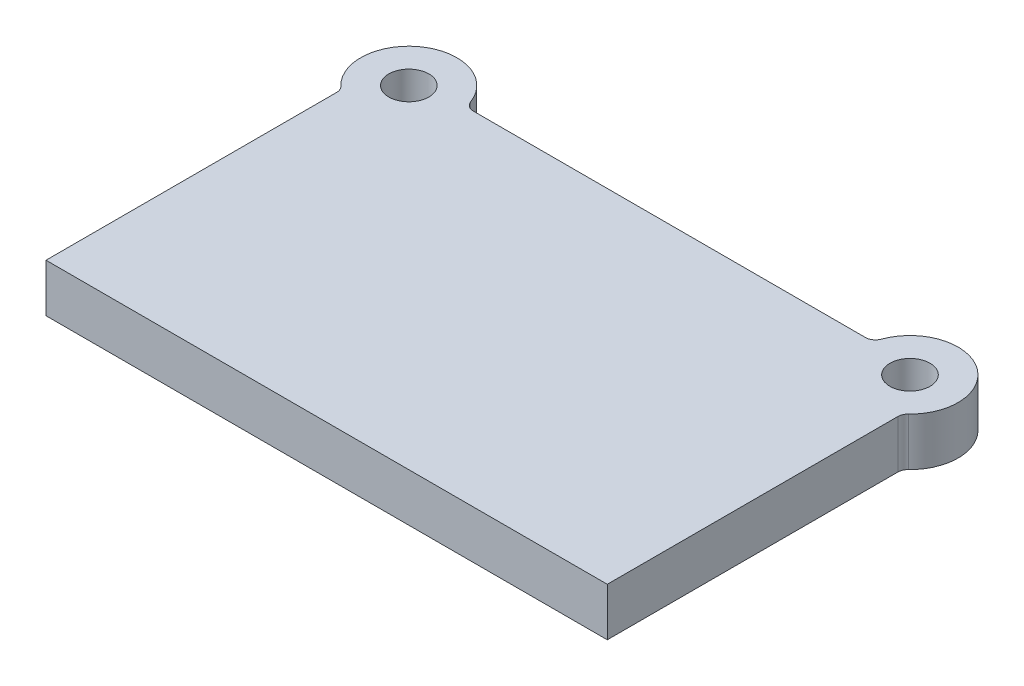
ISO-10303-21;
HEADER;
FILE_DESCRIPTION(('STEP AP214'),'2;1');
FILE_NAME('part.step','',(''),(''),'','','');
FILE_SCHEMA(('AUTOMOTIVE_DESIGN { 1 0 10303 214 1 1 1 1 }'));
ENDSEC;
DATA;
#1=APPLICATION_CONTEXT('core data for automotive mechanical design processes');
#2=APPLICATION_PROTOCOL_DEFINITION('international standard','automotive_design',2000,#1);
#3=PRODUCT_CONTEXT('',#1,'mechanical');
#4=PRODUCT('Part','Part','',(#3));
#5=PRODUCT_RELATED_PRODUCT_CATEGORY('part','',(#4));
#6=PRODUCT_DEFINITION_FORMATION('','',#4);
#7=PRODUCT_DEFINITION_CONTEXT('part definition',#1,'design');
#8=PRODUCT_DEFINITION('design','',#6,#7);
#9=PRODUCT_DEFINITION_SHAPE('','',#8);
#10=(LENGTH_UNIT() NAMED_UNIT(*) SI_UNIT(.MILLI.,.METRE.));
#11=(NAMED_UNIT(*) PLANE_ANGLE_UNIT() SI_UNIT($,.RADIAN.));
#12=(NAMED_UNIT(*) SI_UNIT($,.STERADIAN.) SOLID_ANGLE_UNIT());
#13=UNCERTAINTY_MEASURE_WITH_UNIT(LENGTH_MEASURE(1.E-05),#10,'distance_accuracy_value','');
#14=(GEOMETRIC_REPRESENTATION_CONTEXT(3) GLOBAL_UNCERTAINTY_ASSIGNED_CONTEXT((#13)) GLOBAL_UNIT_ASSIGNED_CONTEXT((#10,
#11,#12)) REPRESENTATION_CONTEXT('',''));
#15=CARTESIAN_POINT('',(0.,0.,0.));
#16=DIRECTION('',(0.,0.,1.));
#17=DIRECTION('',(1.,0.,0.));
#18=AXIS2_PLACEMENT_3D('',#15,#16,#17);
#19=CARTESIAN_POINT('',(-250.,48.,-332.));
#20=DIRECTION('',(0.,1.,0.));
#21=DIRECTION('',(0.,0.,1.));
#22=AXIS2_PLACEMENT_3D('',#19,#20,#21);
#23=PLANE('',#22);
#24=CARTESIAN_POINT('',(-250.,48.,-332.));
#25=DIRECTION('',(0.,1.,0.));
#26=DIRECTION('',(0.,0.,1.));
#27=AXIS2_PLACEMENT_3D('',#24,#25,#26);
#28=CIRCLE('',#27,20.);
#29=CARTESIAN_POINT('',(-250.,48.,-312.));
#30=VERTEX_POINT('',#29);
#31=EDGE_CURVE('E209',#30,#30,#28,.T.);
#32=ORIENTED_EDGE('',*,*,#31,.F.);
#33=EDGE_LOOP('',(#32));
#34=FACE_BOUND('',#33,.T.);
#35=CARTESIAN_POINT('',(-250.,48.,-332.));
#36=DIRECTION('',(0.,1.,0.));
#37=DIRECTION('',(0.,0.,1.));
#38=AXIS2_PLACEMENT_3D('',#35,#36,#37);
#39=CIRCLE('',#38,48.);
#40=CARTESIAN_POINT('',(-204.944030050815,48.,-348.551724137931));
#41=VERTEX_POINT('',#40);
#42=CARTESIAN_POINT('',(-283.103448275862,48.,-297.241379310345));
#43=VERTEX_POINT('',#42);
#44=EDGE_CURVE('E139',#41,#43,#39,.T.);
#45=ORIENTED_EDGE('',*,*,#44,.T.);
#46=CARTESIAN_POINT('',(-290.,48.,-290.));
#47=DIRECTION('',(0.,1.,0.));
#48=DIRECTION('',(0.,0.,1.));
#49=AXIS2_PLACEMENT_3D('',#46,#47,#48);
#50=CIRCLE('',#49,10.);
#51=CARTESIAN_POINT('',(-280.,48.,-290.));
#52=VERTEX_POINT('',#51);
#53=EDGE_CURVE('E116',#43,#52,#50,.F.);
#54=ORIENTED_EDGE('',*,*,#53,.T.);
#55=DIRECTION('',(0.,0.,1.));
#56=VECTOR('',#55,1.);
#57=CARTESIAN_POINT('',(-280.,48.,0.));
#58=LINE('',#57,#56);
#59=CARTESIAN_POINT('',(-280.,48.,0.));
#60=VERTEX_POINT('',#59);
#61=EDGE_CURVE('E109',#52,#60,#58,.T.);
#62=ORIENTED_EDGE('',*,*,#61,.T.);
#63=DIRECTION('',(1.,0.,0.));
#64=VECTOR('',#63,1.);
#65=CARTESIAN_POINT('',(280.,48.,0.));
#66=LINE('',#65,#64);
#67=CARTESIAN_POINT('',(280.,48.,0.));
#68=VERTEX_POINT('',#67);
#69=EDGE_CURVE('E113',#60,#68,#66,.T.);
#70=ORIENTED_EDGE('',*,*,#69,.T.);
#71=DIRECTION('',(0.,0.,-1.));
#72=VECTOR('',#71,1.);
#73=CARTESIAN_POINT('',(280.,48.,0.));
#74=LINE('',#73,#72);
#75=CARTESIAN_POINT('',(280.,48.,-290.));
#76=VERTEX_POINT('',#75);
#77=EDGE_CURVE('E129',#68,#76,#74,.T.);
#78=ORIENTED_EDGE('',*,*,#77,.T.);
#79=CARTESIAN_POINT('',(290.,48.,-290.));
#80=DIRECTION('',(0.,1.,0.));
#81=DIRECTION('',(0.,0.,1.));
#82=AXIS2_PLACEMENT_3D('',#79,#80,#81);
#83=CIRCLE('',#82,10.);
#84=CARTESIAN_POINT('',(283.103448275862,48.,-297.241379310345));
#85=VERTEX_POINT('',#84);
#86=EDGE_CURVE('E11',#76,#85,#83,.F.);
#87=ORIENTED_EDGE('',*,*,#86,.T.);
#88=CARTESIAN_POINT('',(250.,48.,-332.));
#89=DIRECTION('',(0.,1.,0.));
#90=DIRECTION('',(0.,0.,-1.));
#91=AXIS2_PLACEMENT_3D('',#88,#89,#90);
#92=CIRCLE('',#91,48.);
#93=CARTESIAN_POINT('',(204.944030050815,48.,-348.551724137931));
#94=VERTEX_POINT('',#93);
#95=EDGE_CURVE('E175',#85,#94,#92,.T.);
#96=ORIENTED_EDGE('',*,*,#95,.T.);
#97=CARTESIAN_POINT('',(195.557369644735,48.,-352.));
#98=DIRECTION('',(0.,1.,0.));
#99=DIRECTION('',(0.,0.,1.));
#100=AXIS2_PLACEMENT_3D('',#97,#98,#99);
#101=CIRCLE('',#100,10.);
#102=CARTESIAN_POINT('',(195.557369644735,48.,-342.));
#103=VERTEX_POINT('',#102);
#104=EDGE_CURVE('E167',#94,#103,#101,.F.);
#105=ORIENTED_EDGE('',*,*,#104,.T.);
#106=DIRECTION('',(-1.,0.,0.));
#107=VECTOR('',#106,1.);
#108=CARTESIAN_POINT('',(203.053221622778,48.,-342.));
#109=LINE('',#108,#107);
#110=CARTESIAN_POINT('',(-195.557369644735,48.,-342.));
#111=VERTEX_POINT('',#110);
#112=EDGE_CURVE('E172',#103,#111,#109,.T.);
#113=ORIENTED_EDGE('',*,*,#112,.T.);
#114=CARTESIAN_POINT('',(-195.557369644735,48.,-352.));
#115=DIRECTION('',(0.,1.,0.));
#116=DIRECTION('',(0.,0.,1.));
#117=AXIS2_PLACEMENT_3D('',#114,#115,#116);
#118=CIRCLE('',#117,10.);
#119=EDGE_CURVE('E163',#111,#41,#118,.F.);
#120=ORIENTED_EDGE('',*,*,#119,.T.);
#121=EDGE_LOOP('',(#45,#54,#62,#70,#78,#87,#96,#105,#113,#120));
#122=FACE_BOUND('',#121,.T.);
#123=CARTESIAN_POINT('',(250.,48.,-332.));
#124=DIRECTION('',(0.,1.,0.));
#125=DIRECTION('',(0.,0.,-1.));
#126=AXIS2_PLACEMENT_3D('',#123,#124,#125);
#127=CIRCLE('',#126,20.);
#128=CARTESIAN_POINT('',(250.,48.,-352.));
#129=VERTEX_POINT('',#128);
#130=EDGE_CURVE('E219',#129,#129,#127,.T.);
#131=ORIENTED_EDGE('',*,*,#130,.F.);
#132=EDGE_LOOP('',(#131));
#133=FACE_BOUND('',#132,.T.);
#134=ADVANCED_FACE('F33',(#34,#122,#133),#23,.T.);
#135=CARTESIAN_POINT('',(-250.,0.,-332.));
#136=DIRECTION('',(0.,1.,0.));
#137=DIRECTION('',(0.,0.,1.));
#138=AXIS2_PLACEMENT_3D('',#135,#136,#137);
#139=PLANE('',#138);
#140=DIRECTION('',(0.,0.,1.));
#141=VECTOR('',#140,1.);
#142=CARTESIAN_POINT('',(-280.,0.,0.));
#143=LINE('',#142,#141);
#144=CARTESIAN_POINT('',(-280.,0.,-290.));
#145=VERTEX_POINT('',#144);
#146=CARTESIAN_POINT('',(-280.,0.,0.));
#147=VERTEX_POINT('',#146);
#148=EDGE_CURVE('E133',#145,#147,#143,.T.);
#149=ORIENTED_EDGE('',*,*,#148,.F.);
#150=CARTESIAN_POINT('',(-290.,0.,-290.));
#151=DIRECTION('',(0.,1.,0.));
#152=DIRECTION('',(0.,0.,1.));
#153=AXIS2_PLACEMENT_3D('',#150,#151,#152);
#154=CIRCLE('',#153,10.);
#155=CARTESIAN_POINT('',(-283.103448275862,0.,-297.241379310345));
#156=VERTEX_POINT('',#155);
#157=EDGE_CURVE('E158',#145,#156,#154,.T.);
#158=ORIENTED_EDGE('',*,*,#157,.T.);
#159=CARTESIAN_POINT('',(-250.,0.,-332.));
#160=DIRECTION('',(0.,1.,0.));
#161=DIRECTION('',(0.,0.,1.));
#162=AXIS2_PLACEMENT_3D('',#159,#160,#161);
#163=CIRCLE('',#162,48.);
#164=CARTESIAN_POINT('',(-204.944030050815,0.,-348.551724137931));
#165=VERTEX_POINT('',#164);
#166=EDGE_CURVE('E121',#165,#156,#163,.T.);
#167=ORIENTED_EDGE('',*,*,#166,.F.);
#168=CARTESIAN_POINT('',(-195.557369644735,0.,-352.));
#169=DIRECTION('',(0.,1.,0.));
#170=DIRECTION('',(0.,0.,1.));
#171=AXIS2_PLACEMENT_3D('',#168,#169,#170);
#172=CIRCLE('',#171,10.);
#173=CARTESIAN_POINT('',(-195.557369644735,0.,-342.));
#174=VERTEX_POINT('',#173);
#175=EDGE_CURVE('E161',#165,#174,#172,.T.);
#176=ORIENTED_EDGE('',*,*,#175,.T.);
#177=DIRECTION('',(-1.,0.,0.));
#178=VECTOR('',#177,1.);
#179=CARTESIAN_POINT('',(203.053221622778,0.,-342.));
#180=LINE('',#179,#178);
#181=CARTESIAN_POINT('',(195.557369644735,0.,-342.));
#182=VERTEX_POINT('',#181);
#183=EDGE_CURVE('E190',#182,#174,#180,.T.);
#184=ORIENTED_EDGE('',*,*,#183,.F.);
#185=CARTESIAN_POINT('',(195.557369644735,0.,-352.));
#186=DIRECTION('',(0.,1.,0.));
#187=DIRECTION('',(0.,0.,1.));
#188=AXIS2_PLACEMENT_3D('',#185,#186,#187);
#189=CIRCLE('',#188,10.);
#190=CARTESIAN_POINT('',(204.944030050815,0.,-348.551724137931));
#191=VERTEX_POINT('',#190);
#192=EDGE_CURVE('E165',#182,#191,#189,.T.);
#193=ORIENTED_EDGE('',*,*,#192,.T.);
#194=CARTESIAN_POINT('',(250.,0.,-332.));
#195=DIRECTION('',(0.,1.,0.));
#196=DIRECTION('',(0.,0.,-1.));
#197=AXIS2_PLACEMENT_3D('',#194,#195,#196);
#198=CIRCLE('',#197,48.);
#199=CARTESIAN_POINT('',(283.103448275862,0.,-297.241379310345));
#200=VERTEX_POINT('',#199);
#201=EDGE_CURVE('E189',#200,#191,#198,.T.);
#202=ORIENTED_EDGE('',*,*,#201,.F.);
#203=CARTESIAN_POINT('',(290.,0.,-290.));
#204=DIRECTION('',(0.,1.,0.));
#205=DIRECTION('',(0.,0.,1.));
#206=AXIS2_PLACEMENT_3D('',#203,#204,#205);
#207=CIRCLE('',#206,10.);
#208=CARTESIAN_POINT('',(280.,0.,-290.));
#209=VERTEX_POINT('',#208);
#210=EDGE_CURVE('E41',#200,#209,#207,.T.);
#211=ORIENTED_EDGE('',*,*,#210,.T.);
#212=DIRECTION('',(0.,0.,-1.));
#213=VECTOR('',#212,1.);
#214=CARTESIAN_POINT('',(280.,0.,0.));
#215=LINE('',#214,#213);
#216=CARTESIAN_POINT('',(280.,0.,0.));
#217=VERTEX_POINT('',#216);
#218=EDGE_CURVE('E194',#217,#209,#215,.T.);
#219=ORIENTED_EDGE('',*,*,#218,.F.);
#220=DIRECTION('',(1.,0.,0.));
#221=VECTOR('',#220,1.);
#222=CARTESIAN_POINT('',(280.,0.,0.));
#223=LINE('',#222,#221);
#224=EDGE_CURVE('E197',#147,#217,#223,.T.);
#225=ORIENTED_EDGE('',*,*,#224,.F.);
#226=EDGE_LOOP('',(#149,#158,#167,#176,#184,#193,#202,#211,#219,#225));
#227=FACE_BOUND('',#226,.T.);
#228=CARTESIAN_POINT('',(-250.,0.,-332.));
#229=DIRECTION('',(0.,1.,0.));
#230=DIRECTION('',(0.,0.,1.));
#231=AXIS2_PLACEMENT_3D('',#228,#229,#230);
#232=CIRCLE('',#231,20.);
#233=CARTESIAN_POINT('',(-250.,0.,-312.));
#234=VERTEX_POINT('',#233);
#235=EDGE_CURVE('E212',#234,#234,#232,.T.);
#236=ORIENTED_EDGE('',*,*,#235,.T.);
#237=EDGE_LOOP('',(#236));
#238=FACE_BOUND('',#237,.T.);
#239=CARTESIAN_POINT('',(250.,0.,-332.));
#240=DIRECTION('',(0.,1.,0.));
#241=DIRECTION('',(0.,0.,-1.));
#242=AXIS2_PLACEMENT_3D('',#239,#240,#241);
#243=CIRCLE('',#242,20.);
#244=CARTESIAN_POINT('',(250.,0.,-352.));
#245=VERTEX_POINT('',#244);
#246=EDGE_CURVE('E221',#245,#245,#243,.T.);
#247=ORIENTED_EDGE('',*,*,#246,.T.);
#248=EDGE_LOOP('',(#247));
#249=FACE_BOUND('',#248,.T.);
#250=ADVANCED_FACE('F187',(#227,#238,#249),#139,.F.);
#251=CARTESIAN_POINT('',(-280.,48.,0.));
#252=DIRECTION('',(1.,0.,0.));
#253=DIRECTION('',(0.,0.,-1.));
#254=AXIS2_PLACEMENT_3D('',#251,#252,#253);
#255=PLANE('',#254);
#256=ORIENTED_EDGE('',*,*,#61,.F.);
#257=DIRECTION('',(0.,1.,0.));
#258=VECTOR('',#257,1.);
#259=CARTESIAN_POINT('',(-280.,0.,-290.));
#260=LINE('',#259,#258);
#261=EDGE_CURVE('E135',#52,#145,#260,.F.);
#262=ORIENTED_EDGE('',*,*,#261,.T.);
#263=ORIENTED_EDGE('',*,*,#148,.T.);
#264=DIRECTION('',(0.,-1.,0.));
#265=VECTOR('',#264,1.);
#266=CARTESIAN_POINT('',(-280.,48.,0.));
#267=LINE('',#266,#265);
#268=EDGE_CURVE('E126',#60,#147,#267,.T.);
#269=ORIENTED_EDGE('',*,*,#268,.F.);
#270=EDGE_LOOP('',(#256,#262,#263,#269));
#271=FACE_BOUND('',#270,.T.);
#272=ADVANCED_FACE('F131',(#271),#255,.F.);
#273=CARTESIAN_POINT('',(280.,48.,0.));
#274=DIRECTION('',(0.,0.,-1.));
#275=DIRECTION('',(-1.,0.,0.));
#276=AXIS2_PLACEMENT_3D('',#273,#274,#275);
#277=PLANE('',#276);
#278=ORIENTED_EDGE('',*,*,#224,.T.);
#279=DIRECTION('',(0.,-1.,0.));
#280=VECTOR('',#279,1.);
#281=CARTESIAN_POINT('',(280.,48.,0.));
#282=LINE('',#281,#280);
#283=EDGE_CURVE('E128',#68,#217,#282,.T.);
#284=ORIENTED_EDGE('',*,*,#283,.F.);
#285=ORIENTED_EDGE('',*,*,#69,.F.);
#286=ORIENTED_EDGE('',*,*,#268,.T.);
#287=EDGE_LOOP('',(#278,#284,#285,#286));
#288=FACE_BOUND('',#287,.T.);
#289=ADVANCED_FACE('F125',(#288),#277,.F.);
#290=CARTESIAN_POINT('',(280.,48.,0.));
#291=DIRECTION('',(-1.,0.,0.));
#292=DIRECTION('',(0.,0.,1.));
#293=AXIS2_PLACEMENT_3D('',#290,#291,#292);
#294=PLANE('',#293);
#295=ORIENTED_EDGE('',*,*,#218,.T.);
#296=DIRECTION('',(0.,1.,0.));
#297=VECTOR('',#296,1.);
#298=CARTESIAN_POINT('',(280.,48.,-290.));
#299=LINE('',#298,#297);
#300=EDGE_CURVE('E48',#209,#76,#299,.T.);
#301=ORIENTED_EDGE('',*,*,#300,.T.);
#302=ORIENTED_EDGE('',*,*,#77,.F.);
#303=ORIENTED_EDGE('',*,*,#283,.T.);
#304=EDGE_LOOP('',(#295,#301,#302,#303));
#305=FACE_BOUND('',#304,.T.);
#306=ADVANCED_FACE('F247',(#305),#294,.F.);
#307=CARTESIAN_POINT('',(250.,48.,-332.));
#308=DIRECTION('',(0.,-1.,0.));
#309=DIRECTION('',(0.,0.,-1.));
#310=AXIS2_PLACEMENT_3D('',#307,#308,#309);
#311=CYLINDRICAL_SURFACE('',#310,48.);
#312=ORIENTED_EDGE('',*,*,#201,.T.);
#313=DIRECTION('',(0.,-1.,0.));
#314=VECTOR('',#313,1.);
#315=CARTESIAN_POINT('',(204.944030050815,48.,-348.551724137931));
#316=LINE('',#315,#314);
#317=EDGE_CURVE('E155',#191,#94,#316,.F.);
#318=ORIENTED_EDGE('',*,*,#317,.T.);
#319=ORIENTED_EDGE('',*,*,#95,.F.);
#320=DIRECTION('',(0.,-1.,0.));
#321=VECTOR('',#320,1.);
#322=CARTESIAN_POINT('',(283.103448275862,48.,-297.241379310345));
#323=LINE('',#322,#321);
#324=EDGE_CURVE('E152',#85,#200,#323,.T.);
#325=ORIENTED_EDGE('',*,*,#324,.T.);
#326=EDGE_LOOP('',(#312,#318,#319,#325));
#327=FACE_BOUND('',#326,.T.);
#328=ADVANCED_FACE('F192',(#327),#311,.T.);
#329=CARTESIAN_POINT('',(203.053221622778,48.,-342.));
#330=DIRECTION('',(0.,0.,1.));
#331=DIRECTION('',(1.,0.,0.));
#332=AXIS2_PLACEMENT_3D('',#329,#330,#331);
#333=PLANE('',#332);
#334=ORIENTED_EDGE('',*,*,#183,.T.);
#335=DIRECTION('',(0.,1.,0.));
#336=VECTOR('',#335,1.);
#337=CARTESIAN_POINT('',(-195.557369644735,48.,-342.));
#338=LINE('',#337,#336);
#339=EDGE_CURVE('E150',#174,#111,#338,.T.);
#340=ORIENTED_EDGE('',*,*,#339,.T.);
#341=ORIENTED_EDGE('',*,*,#112,.F.);
#342=DIRECTION('',(0.,1.,0.));
#343=VECTOR('',#342,1.);
#344=CARTESIAN_POINT('',(195.557369644735,0.,-342.));
#345=LINE('',#344,#343);
#346=EDGE_CURVE('E147',#103,#182,#345,.F.);
#347=ORIENTED_EDGE('',*,*,#346,.T.);
#348=EDGE_LOOP('',(#334,#340,#341,#347));
#349=FACE_BOUND('',#348,.T.);
#350=ADVANCED_FACE('F181',(#349),#333,.F.);
#351=CARTESIAN_POINT('',(-250.,48.,-332.));
#352=DIRECTION('',(0.,-1.,0.));
#353=DIRECTION('',(0.,0.,-1.));
#354=AXIS2_PLACEMENT_3D('',#351,#352,#353);
#355=CYLINDRICAL_SURFACE('',#354,48.);
#356=ORIENTED_EDGE('',*,*,#166,.T.);
#357=DIRECTION('',(0.,-1.,0.));
#358=VECTOR('',#357,1.);
#359=CARTESIAN_POINT('',(-283.103448275862,48.,-297.241379310345));
#360=LINE('',#359,#358);
#361=EDGE_CURVE('E145',#156,#43,#360,.F.);
#362=ORIENTED_EDGE('',*,*,#361,.T.);
#363=ORIENTED_EDGE('',*,*,#44,.F.);
#364=DIRECTION('',(0.,-1.,0.));
#365=VECTOR('',#364,1.);
#366=CARTESIAN_POINT('',(-204.944030050815,48.,-348.551724137931));
#367=LINE('',#366,#365);
#368=EDGE_CURVE('E137',#41,#165,#367,.T.);
#369=ORIENTED_EDGE('',*,*,#368,.T.);
#370=EDGE_LOOP('',(#356,#362,#363,#369));
#371=FACE_BOUND('',#370,.T.);
#372=ADVANCED_FACE('F204',(#371),#355,.T.);
#373=CARTESIAN_POINT('',(-250.,48.,-332.));
#374=DIRECTION('',(0.,-1.,0.));
#375=DIRECTION('',(0.,0.,-1.));
#376=AXIS2_PLACEMENT_3D('',#373,#374,#375);
#377=CYLINDRICAL_SURFACE('',#376,20.);
#378=ORIENTED_EDGE('',*,*,#31,.T.);
#379=EDGE_LOOP('',(#378));
#380=FACE_BOUND('',#379,.T.);
#381=ORIENTED_EDGE('',*,*,#235,.F.);
#382=EDGE_LOOP('',(#381));
#383=FACE_BOUND('',#382,.T.);
#384=ADVANCED_FACE('F238',(#380,#383),#377,.F.);
#385=CARTESIAN_POINT('',(250.,48.,-332.));
#386=DIRECTION('',(0.,-1.,0.));
#387=DIRECTION('',(0.,0.,-1.));
#388=AXIS2_PLACEMENT_3D('',#385,#386,#387);
#389=CYLINDRICAL_SURFACE('',#388,20.);
#390=ORIENTED_EDGE('',*,*,#130,.T.);
#391=EDGE_LOOP('',(#390));
#392=FACE_BOUND('',#391,.T.);
#393=ORIENTED_EDGE('',*,*,#246,.F.);
#394=EDGE_LOOP('',(#393));
#395=FACE_BOUND('',#394,.T.);
#396=ADVANCED_FACE('F227',(#392,#395),#389,.F.);
#397=CARTESIAN_POINT('',(-290.,48.,-290.));
#398=DIRECTION('',(0.,-1.,0.));
#399=DIRECTION('',(0.,0.,-1.));
#400=AXIS2_PLACEMENT_3D('',#397,#398,#399);
#401=CYLINDRICAL_SURFACE('',#400,10.);
#402=ORIENTED_EDGE('',*,*,#53,.F.);
#403=ORIENTED_EDGE('',*,*,#361,.F.);
#404=ORIENTED_EDGE('',*,*,#157,.F.);
#405=ORIENTED_EDGE('',*,*,#261,.F.);
#406=EDGE_LOOP('',(#402,#403,#404,#405));
#407=FACE_BOUND('',#406,.T.);
#408=ADVANCED_FACE('F208',(#407),#401,.F.);
#409=CARTESIAN_POINT('',(-195.557369644735,48.,-352.));
#410=DIRECTION('',(0.,-1.,0.));
#411=DIRECTION('',(0.,0.,-1.));
#412=AXIS2_PLACEMENT_3D('',#409,#410,#411);
#413=CYLINDRICAL_SURFACE('',#412,10.);
#414=ORIENTED_EDGE('',*,*,#119,.F.);
#415=ORIENTED_EDGE('',*,*,#339,.F.);
#416=ORIENTED_EDGE('',*,*,#175,.F.);
#417=ORIENTED_EDGE('',*,*,#368,.F.);
#418=EDGE_LOOP('',(#414,#415,#416,#417));
#419=FACE_BOUND('',#418,.T.);
#420=ADVANCED_FACE('F256',(#419),#413,.F.);
#421=CARTESIAN_POINT('',(195.557369644735,48.,-352.));
#422=DIRECTION('',(0.,-1.,0.));
#423=DIRECTION('',(0.,0.,-1.));
#424=AXIS2_PLACEMENT_3D('',#421,#422,#423);
#425=CYLINDRICAL_SURFACE('',#424,10.);
#426=ORIENTED_EDGE('',*,*,#104,.F.);
#427=ORIENTED_EDGE('',*,*,#317,.F.);
#428=ORIENTED_EDGE('',*,*,#192,.F.);
#429=ORIENTED_EDGE('',*,*,#346,.F.);
#430=EDGE_LOOP('',(#426,#427,#428,#429));
#431=FACE_BOUND('',#430,.T.);
#432=ADVANCED_FACE('F185',(#431),#425,.F.);
#433=CARTESIAN_POINT('',(290.,48.,-290.));
#434=DIRECTION('',(0.,-1.,0.));
#435=DIRECTION('',(0.,0.,-1.));
#436=AXIS2_PLACEMENT_3D('',#433,#434,#435);
#437=CYLINDRICAL_SURFACE('',#436,10.);
#438=ORIENTED_EDGE('',*,*,#86,.F.);
#439=ORIENTED_EDGE('',*,*,#300,.F.);
#440=ORIENTED_EDGE('',*,*,#210,.F.);
#441=ORIENTED_EDGE('',*,*,#324,.F.);
#442=EDGE_LOOP('',(#438,#439,#440,#441));
#443=FACE_BOUND('',#442,.T.);
#444=ADVANCED_FACE('F35',(#443),#437,.F.);
#445=CLOSED_SHELL('',(#134,#250,#272,#289,#306,#328,#350,#372,#384,#396,#408,#420,#432,#444));
#446=MANIFOLD_SOLID_BREP('B2',#445);
#447=ADVANCED_BREP_SHAPE_REPRESENTATION('',(#18,#446),#14);
#448=SHAPE_DEFINITION_REPRESENTATION(#9,#447);
ENDSEC;
END-ISO-10303-21;
